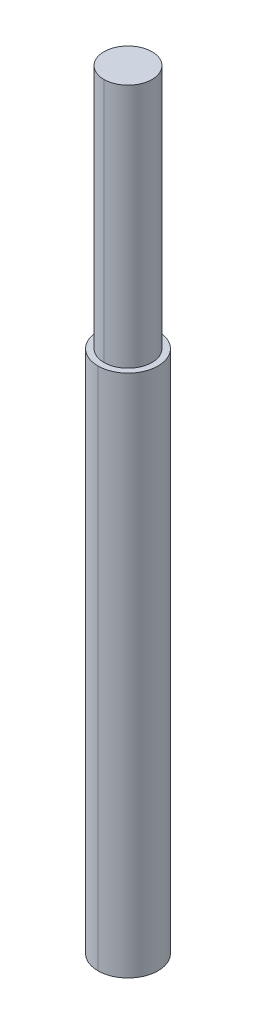
ISO-10303-21;
HEADER;
FILE_DESCRIPTION(('STEP AP214'),'2;1');
FILE_NAME('part.step','',(''),(''),'','','');
FILE_SCHEMA(('AUTOMOTIVE_DESIGN { 1 0 10303 214 1 1 1 1 }'));
ENDSEC;
DATA;
#1=APPLICATION_CONTEXT('core data for automotive mechanical design processes');
#2=APPLICATION_PROTOCOL_DEFINITION('international standard','automotive_design',2000,#1);
#3=PRODUCT_CONTEXT('',#1,'mechanical');
#4=PRODUCT('Part','Part','',(#3));
#5=PRODUCT_RELATED_PRODUCT_CATEGORY('part','',(#4));
#6=PRODUCT_DEFINITION_FORMATION('','',#4);
#7=PRODUCT_DEFINITION_CONTEXT('part definition',#1,'design');
#8=PRODUCT_DEFINITION('design','',#6,#7);
#9=PRODUCT_DEFINITION_SHAPE('','',#8);
#10=(LENGTH_UNIT() NAMED_UNIT(*) SI_UNIT(.MILLI.,.METRE.));
#11=(NAMED_UNIT(*) PLANE_ANGLE_UNIT() SI_UNIT($,.RADIAN.));
#12=(NAMED_UNIT(*) SI_UNIT($,.STERADIAN.) SOLID_ANGLE_UNIT());
#13=UNCERTAINTY_MEASURE_WITH_UNIT(LENGTH_MEASURE(1.E-05),#10,'distance_accuracy_value','');
#14=(GEOMETRIC_REPRESENTATION_CONTEXT(3) GLOBAL_UNCERTAINTY_ASSIGNED_CONTEXT((#13)) GLOBAL_UNIT_ASSIGNED_CONTEXT((#10,
#11,#12)) REPRESENTATION_CONTEXT('',''));
#15=CARTESIAN_POINT('',(0.,0.,0.));
#16=DIRECTION('',(0.,0.,1.));
#17=DIRECTION('',(1.,0.,0.));
#18=AXIS2_PLACEMENT_3D('',#15,#16,#17);
#19=CARTESIAN_POINT('',(0.,32.,0.));
#20=DIRECTION('',(0.,1.,0.));
#21=DIRECTION('',(1.,0.,0.));
#22=AXIS2_PLACEMENT_3D('',#19,#20,#21);
#23=PLANE('',#22);
#24=CARTESIAN_POINT('',(0.,32.,0.));
#25=DIRECTION('',(0.,1.,0.));
#26=DIRECTION('',(0.,0.,1.));
#27=AXIS2_PLACEMENT_3D('',#24,#25,#26);
#28=CIRCLE('',#27,1.);
#29=CARTESIAN_POINT('',(0.,32.,-1.));
#30=VERTEX_POINT('',#29);
#31=CARTESIAN_POINT('',(0.,32.,1.));
#32=VERTEX_POINT('',#31);
#33=EDGE_CURVE('E11',#30,#32,#28,.T.);
#34=ORIENTED_EDGE('',*,*,#33,.T.);
#35=CARTESIAN_POINT('',(0.,32.,0.));
#36=DIRECTION('',(0.,1.,0.));
#37=DIRECTION('',(0.,0.,1.));
#38=AXIS2_PLACEMENT_3D('',#35,#36,#37);
#39=CIRCLE('',#38,1.);
#40=EDGE_CURVE('E84',#32,#30,#39,.T.);
#41=ORIENTED_EDGE('',*,*,#40,.T.);
#42=EDGE_LOOP('',(#34,#41));
#43=FACE_BOUND('',#42,.T.);
#44=ADVANCED_FACE('F16',(#43),#23,.T.);
#45=CARTESIAN_POINT('',(0.,32.,0.));
#46=DIRECTION('',(0.,-1.,0.));
#47=DIRECTION('',(0.,0.,-1.));
#48=AXIS2_PLACEMENT_3D('',#45,#46,#47);
#49=CYLINDRICAL_SURFACE('',#48,1.);
#50=DIRECTION('',(0.,-1.,0.));
#51=VECTOR('',#50,1.);
#52=CARTESIAN_POINT('',(0.,32.,1.));
#53=LINE('',#52,#51);
#54=CARTESIAN_POINT('',(0.,21.8,1.));
#55=VERTEX_POINT('',#54);
#56=EDGE_CURVE('E87',#32,#55,#53,.T.);
#57=ORIENTED_EDGE('',*,*,#56,.F.);
#58=ORIENTED_EDGE('',*,*,#33,.F.);
#59=DIRECTION('',(0.,-1.,0.));
#60=VECTOR('',#59,1.);
#61=CARTESIAN_POINT('',(0.,32.,-1.));
#62=LINE('',#61,#60);
#63=CARTESIAN_POINT('',(0.,21.8,-1.));
#64=VERTEX_POINT('',#63);
#65=EDGE_CURVE('E95',#30,#64,#62,.T.);
#66=ORIENTED_EDGE('',*,*,#65,.T.);
#67=CARTESIAN_POINT('',(0.,21.8,0.));
#68=DIRECTION('',(0.,1.,0.));
#69=DIRECTION('',(0.,0.,1.));
#70=AXIS2_PLACEMENT_3D('',#67,#68,#69);
#71=CIRCLE('',#70,1.);
#72=EDGE_CURVE('E27',#64,#55,#71,.T.);
#73=ORIENTED_EDGE('',*,*,#72,.T.);
#74=EDGE_LOOP('',(#57,#58,#66,#73));
#75=FACE_BOUND('',#74,.T.);
#76=ADVANCED_FACE('F88',(#75),#49,.T.);
#77=CARTESIAN_POINT('',(0.,0.,0.));
#78=DIRECTION('',(0.,1.,0.));
#79=DIRECTION('',(1.,0.,0.));
#80=AXIS2_PLACEMENT_3D('',#77,#78,#79);
#81=PLANE('',#80);
#82=CARTESIAN_POINT('',(0.,0.,0.));
#83=DIRECTION('',(0.,1.,0.));
#84=DIRECTION('',(0.,0.,1.));
#85=AXIS2_PLACEMENT_3D('',#82,#83,#84);
#86=CIRCLE('',#85,1.25);
#87=CARTESIAN_POINT('',(0.,0.,-1.25));
#88=VERTEX_POINT('',#87);
#89=CARTESIAN_POINT('',(0.,0.,1.25));
#90=VERTEX_POINT('',#89);
#91=EDGE_CURVE('E20',#88,#90,#86,.T.);
#92=ORIENTED_EDGE('',*,*,#91,.F.);
#93=CARTESIAN_POINT('',(0.,0.,0.));
#94=DIRECTION('',(0.,1.,0.));
#95=DIRECTION('',(0.,0.,1.));
#96=AXIS2_PLACEMENT_3D('',#93,#94,#95);
#97=CIRCLE('',#96,1.25);
#98=EDGE_CURVE('E107',#90,#88,#97,.T.);
#99=ORIENTED_EDGE('',*,*,#98,.F.);
#100=EDGE_LOOP('',(#92,#99));
#101=FACE_BOUND('',#100,.T.);
#102=ADVANCED_FACE('F18',(#101),#81,.F.);
#103=CARTESIAN_POINT('',(0.,21.8,0.));
#104=DIRECTION('',(0.,1.,0.));
#105=DIRECTION('',(1.,0.,0.));
#106=AXIS2_PLACEMENT_3D('',#103,#104,#105);
#107=PLANE('',#106);
#108=ORIENTED_EDGE('',*,*,#72,.F.);
#109=CARTESIAN_POINT('',(0.,21.8,0.));
#110=DIRECTION('',(0.,1.,0.));
#111=DIRECTION('',(0.,0.,1.));
#112=AXIS2_PLACEMENT_3D('',#109,#110,#111);
#113=CIRCLE('',#112,1.);
#114=EDGE_CURVE('E92',#55,#64,#113,.T.);
#115=ORIENTED_EDGE('',*,*,#114,.F.);
#116=EDGE_LOOP('',(#108,#115));
#117=FACE_BOUND('',#116,.T.);
#118=CARTESIAN_POINT('',(0.,21.8,0.));
#119=DIRECTION('',(0.,1.,0.));
#120=DIRECTION('',(0.,0.,1.));
#121=AXIS2_PLACEMENT_3D('',#118,#119,#120);
#122=CIRCLE('',#121,1.25);
#123=CARTESIAN_POINT('',(0.,21.8,-1.25));
#124=VERTEX_POINT('',#123);
#125=CARTESIAN_POINT('',(0.,21.8,1.25));
#126=VERTEX_POINT('',#125);
#127=EDGE_CURVE('E55',#124,#126,#122,.T.);
#128=ORIENTED_EDGE('',*,*,#127,.T.);
#129=CARTESIAN_POINT('',(0.,21.8,0.));
#130=DIRECTION('',(0.,1.,0.));
#131=DIRECTION('',(0.,0.,1.));
#132=AXIS2_PLACEMENT_3D('',#129,#130,#131);
#133=CIRCLE('',#132,1.25);
#134=EDGE_CURVE('E103',#126,#124,#133,.T.);
#135=ORIENTED_EDGE('',*,*,#134,.T.);
#136=EDGE_LOOP('',(#128,#135));
#137=FACE_BOUND('',#136,.T.);
#138=ADVANCED_FACE('F125',(#117,#137),#107,.T.);
#139=CARTESIAN_POINT('',(0.,21.8,0.));
#140=DIRECTION('',(0.,-1.,0.));
#141=DIRECTION('',(0.,0.,-1.));
#142=AXIS2_PLACEMENT_3D('',#139,#140,#141);
#143=CYLINDRICAL_SURFACE('',#142,1.25);
#144=DIRECTION('',(0.,-1.,0.));
#145=VECTOR('',#144,1.);
#146=CARTESIAN_POINT('',(0.,21.8,1.25));
#147=LINE('',#146,#145);
#148=EDGE_CURVE('E110',#126,#90,#147,.T.);
#149=ORIENTED_EDGE('',*,*,#148,.F.);
#150=ORIENTED_EDGE('',*,*,#127,.F.);
#151=DIRECTION('',(0.,-1.,0.));
#152=VECTOR('',#151,1.);
#153=CARTESIAN_POINT('',(0.,21.8,-1.25));
#154=LINE('',#153,#152);
#155=EDGE_CURVE('E106',#124,#88,#154,.T.);
#156=ORIENTED_EDGE('',*,*,#155,.T.);
#157=ORIENTED_EDGE('',*,*,#91,.T.);
#158=EDGE_LOOP('',(#149,#150,#156,#157));
#159=FACE_BOUND('',#158,.T.);
#160=ADVANCED_FACE('F130',(#159),#143,.T.);
#161=CARTESIAN_POINT('',(0.,21.8,0.));
#162=DIRECTION('',(0.,-1.,0.));
#163=DIRECTION('',(0.,0.,-1.));
#164=AXIS2_PLACEMENT_3D('',#161,#162,#163);
#165=CYLINDRICAL_SURFACE('',#164,1.25);
#166=ORIENTED_EDGE('',*,*,#134,.F.);
#167=ORIENTED_EDGE('',*,*,#148,.T.);
#168=ORIENTED_EDGE('',*,*,#98,.T.);
#169=ORIENTED_EDGE('',*,*,#155,.F.);
#170=EDGE_LOOP('',(#166,#167,#168,#169));
#171=FACE_BOUND('',#170,.T.);
#172=ADVANCED_FACE('F128',(#171),#165,.T.);
#173=CARTESIAN_POINT('',(0.,32.,0.));
#174=DIRECTION('',(0.,-1.,0.));
#175=DIRECTION('',(0.,0.,-1.));
#176=AXIS2_PLACEMENT_3D('',#173,#174,#175);
#177=CYLINDRICAL_SURFACE('',#176,1.);
#178=ORIENTED_EDGE('',*,*,#40,.F.);
#179=ORIENTED_EDGE('',*,*,#56,.T.);
#180=ORIENTED_EDGE('',*,*,#114,.T.);
#181=ORIENTED_EDGE('',*,*,#65,.F.);
#182=EDGE_LOOP('',(#178,#179,#180,#181));
#183=FACE_BOUND('',#182,.T.);
#184=ADVANCED_FACE('F94',(#183),#177,.T.);
#185=CLOSED_SHELL('',(#44,#76,#102,#138,#160,#172,#184));
#186=MANIFOLD_SOLID_BREP('B1',#185);
#187=ADVANCED_BREP_SHAPE_REPRESENTATION('',(#18,#186),#14);
#188=SHAPE_DEFINITION_REPRESENTATION(#9,#187);
ENDSEC;
END-ISO-10303-21;
